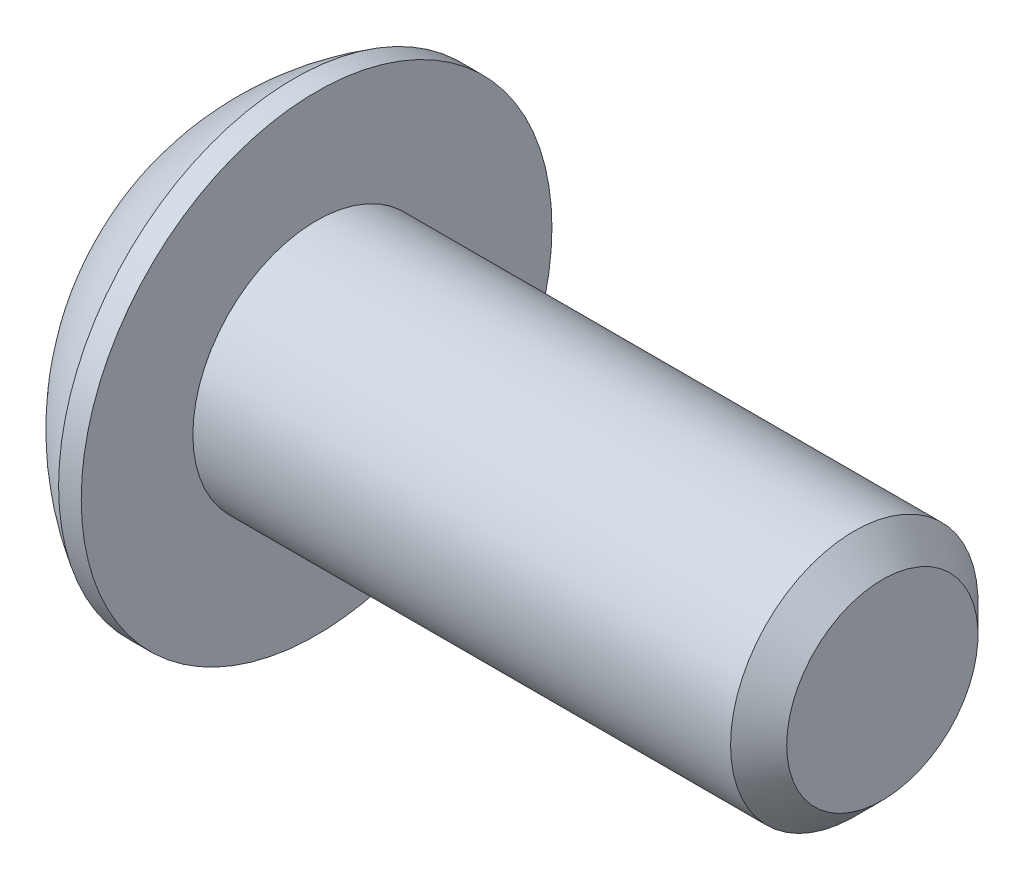
ISO-10303-21;
HEADER;
FILE_DESCRIPTION(('STEP AP214'),'2;1');
FILE_NAME('part.step','',(''),(''),'','','');
FILE_SCHEMA(('AUTOMOTIVE_DESIGN { 1 0 10303 214 1 1 1 1 }'));
ENDSEC;
DATA;
#1=APPLICATION_CONTEXT('core data for automotive mechanical design processes');
#2=APPLICATION_PROTOCOL_DEFINITION('international standard','automotive_design',2000,#1);
#3=PRODUCT_CONTEXT('',#1,'mechanical');
#4=PRODUCT('Part','Part','',(#3));
#5=PRODUCT_RELATED_PRODUCT_CATEGORY('part','',(#4));
#6=PRODUCT_DEFINITION_FORMATION('','',#4);
#7=PRODUCT_DEFINITION_CONTEXT('part definition',#1,'design');
#8=PRODUCT_DEFINITION('design','',#6,#7);
#9=PRODUCT_DEFINITION_SHAPE('','',#8);
#10=(LENGTH_UNIT() NAMED_UNIT(*) SI_UNIT(.MILLI.,.METRE.));
#11=(NAMED_UNIT(*) PLANE_ANGLE_UNIT() SI_UNIT($,.RADIAN.));
#12=(NAMED_UNIT(*) SI_UNIT($,.STERADIAN.) SOLID_ANGLE_UNIT());
#13=UNCERTAINTY_MEASURE_WITH_UNIT(LENGTH_MEASURE(1.E-05),#10,'distance_accuracy_value','');
#14=(GEOMETRIC_REPRESENTATION_CONTEXT(3) GLOBAL_UNCERTAINTY_ASSIGNED_CONTEXT((#13)) GLOBAL_UNIT_ASSIGNED_CONTEXT((#10,
#11,#12)) REPRESENTATION_CONTEXT('',''));
#15=CARTESIAN_POINT('',(0.,0.,0.));
#16=DIRECTION('',(0.,0.,1.));
#17=DIRECTION('',(1.,0.,0.));
#18=AXIS2_PLACEMENT_3D('',#15,#16,#17);
#19=CARTESIAN_POINT('',(1.32080000014412,0.,0.));
#20=DIRECTION('',(-1.,0.,0.));
#21=DIRECTION('',(0.,0.,1.));
#22=AXIS2_PLACEMENT_3D('',#19,#20,#21);
#23=CONICAL_SURFACE('',#22,1.19379999978264,1.04719755093309);
#24=CARTESIAN_POINT('',(2.01004075151445,0.,2.27373675443232E-10));
#25=VERTEX_POINT('',#24);
#26=VERTEX_LOOP('',#25);
#27=FACE_BOUND('',#26,.T.);
#28=CARTESIAN_POINT('',(1.32080000001284,0.,0.));
#29=DIRECTION('',(-1.,0.,0.));
#30=DIRECTION('',(0.,0.,1.));
#31=AXIS2_PLACEMENT_3D('',#28,#29,#30);
#32=CIRCLE('',#31,1.19380000001001);
#33=CARTESIAN_POINT('',(1.32080000000644,-1.0338611270422,0.596900000002507));
#34=VERTEX_POINT('',#33);
#35=CARTESIAN_POINT('',(1.32080000000644,0.,1.19380000000501));
#36=VERTEX_POINT('',#35);
#37=EDGE_CURVE('E92',#34,#36,#32,.T.);
#38=ORIENTED_EDGE('',*,*,#37,.T.);
#39=CARTESIAN_POINT('',(1.32080000001284,0.,0.));
#40=DIRECTION('',(-1.,0.,0.));
#41=DIRECTION('',(0.,0.,1.));
#42=AXIS2_PLACEMENT_3D('',#39,#40,#41);
#43=CIRCLE('',#42,1.19380000001001);
#44=CARTESIAN_POINT('',(1.32080000000644,1.0338611270422,0.596900000002507));
#45=VERTEX_POINT('',#44);
#46=EDGE_CURVE('E88',#36,#45,#43,.T.);
#47=ORIENTED_EDGE('',*,*,#46,.T.);
#48=CARTESIAN_POINT('',(1.32080000001284,0.,0.));
#49=DIRECTION('',(-1.,0.,0.));
#50=DIRECTION('',(0.,0.,1.));
#51=AXIS2_PLACEMENT_3D('',#48,#49,#50);
#52=CIRCLE('',#51,1.19380000001001);
#53=CARTESIAN_POINT('',(1.32080000000644,1.0338611270422,-0.596900000002503));
#54=VERTEX_POINT('',#53);
#55=EDGE_CURVE('E21',#45,#54,#52,.T.);
#56=ORIENTED_EDGE('',*,*,#55,.T.);
#57=CARTESIAN_POINT('',(1.32080000001284,0.,0.));
#58=DIRECTION('',(-1.,0.,0.));
#59=DIRECTION('',(0.,0.,1.));
#60=AXIS2_PLACEMENT_3D('',#57,#58,#59);
#61=CIRCLE('',#60,1.19380000001001);
#62=CARTESIAN_POINT('',(1.32080000000644,1.49193044797401E-12,-1.193800000005));
#63=VERTEX_POINT('',#62);
#64=EDGE_CURVE('E151',#54,#63,#61,.T.);
#65=ORIENTED_EDGE('',*,*,#64,.T.);
#66=CARTESIAN_POINT('',(1.32080000001284,0.,0.));
#67=DIRECTION('',(-1.,0.,0.));
#68=DIRECTION('',(0.,0.,1.));
#69=AXIS2_PLACEMENT_3D('',#66,#67,#68);
#70=CIRCLE('',#69,1.19380000001001);
#71=CARTESIAN_POINT('',(1.32080000000644,-1.03386112704219,-0.596900000002507));
#72=VERTEX_POINT('',#71);
#73=EDGE_CURVE('E153',#63,#72,#70,.T.);
#74=ORIENTED_EDGE('',*,*,#73,.T.);
#75=CARTESIAN_POINT('',(1.32080000001284,0.,0.));
#76=DIRECTION('',(-1.,0.,0.));
#77=DIRECTION('',(0.,0.,1.));
#78=AXIS2_PLACEMENT_3D('',#75,#76,#77);
#79=CIRCLE('',#78,1.19380000001001);
#80=EDGE_CURVE('E155',#72,#34,#79,.T.);
#81=ORIENTED_EDGE('',*,*,#80,.T.);
#82=EDGE_LOOP('',(#38,#47,#56,#65,#74,#81));
#83=FACE_BOUND('',#82,.T.);
#84=ADVANCED_FACE('F17',(#27,#83),#23,.F.);
#85=CARTESIAN_POINT('',(1.32080000000001,-2.06772225407572,-1.19379999999998));
#86=DIRECTION('',(1.,0.,0.));
#87=DIRECTION('',(0.,0.,-1.));
#88=AXIS2_PLACEMENT_3D('',#85,#86,#87);
#89=PLANE('',#88);
#90=DIRECTION('',(0.,-0.5,-0.866025403784439));
#91=VECTOR('',#90,1.);
#92=CARTESIAN_POINT('',(1.32080000000004,1.37848150271715,0.));
#93=LINE('',#92,#91);
#94=CARTESIAN_POINT('',(1.32080000000002,1.37848150271715,0.));
#95=VERTEX_POINT('',#94);
#96=EDGE_CURVE('E104',#54,#95,#93,.F.);
#97=ORIENTED_EDGE('',*,*,#96,.F.);
#98=ORIENTED_EDGE('',*,*,#55,.F.);
#99=DIRECTION('',(0.,0.5,-0.866025403784439));
#100=VECTOR('',#99,1.);
#101=CARTESIAN_POINT('',(1.32080000000001,0.689240751358577,1.1938));
#102=LINE('',#101,#100);
#103=EDGE_CURVE('E102',#95,#45,#102,.F.);
#104=ORIENTED_EDGE('',*,*,#103,.F.);
#105=EDGE_LOOP('',(#97,#98,#104));
#106=FACE_BOUND('',#105,.T.);
#107=ADVANCED_FACE('F100',(#106),#89,.F.);
#108=CARTESIAN_POINT('',(1.32080000000001,-2.06772225407572,-1.19379999999998));
#109=DIRECTION('',(1.,0.,0.));
#110=DIRECTION('',(0.,0.,-1.));
#111=AXIS2_PLACEMENT_3D('',#108,#109,#110);
#112=PLANE('',#111);
#113=DIRECTION('',(0.,0.5,-0.866025403784439));
#114=VECTOR('',#113,1.);
#115=CARTESIAN_POINT('',(1.32080000000004,0.689240751358577,1.1938));
#116=LINE('',#115,#114);
#117=CARTESIAN_POINT('',(1.32080000000002,0.689240751358577,1.1938));
#118=VERTEX_POINT('',#117);
#119=EDGE_CURVE('E106',#45,#118,#116,.F.);
#120=ORIENTED_EDGE('',*,*,#119,.F.);
#121=ORIENTED_EDGE('',*,*,#46,.F.);
#122=DIRECTION('',(0.,1.,0.));
#123=VECTOR('',#122,1.);
#124=CARTESIAN_POINT('',(1.32080000000001,-0.689240751358573,1.19380000000001));
#125=LINE('',#124,#123);
#126=EDGE_CURVE('E109',#118,#36,#125,.F.);
#127=ORIENTED_EDGE('',*,*,#126,.F.);
#128=EDGE_LOOP('',(#120,#121,#127));
#129=FACE_BOUND('',#128,.T.);
#130=ADVANCED_FACE('F107',(#129),#112,.F.);
#131=CARTESIAN_POINT('',(1.32080000000001,-2.06772225407572,-1.19379999999998));
#132=DIRECTION('',(1.,0.,0.));
#133=DIRECTION('',(0.,0.,-1.));
#134=AXIS2_PLACEMENT_3D('',#131,#132,#133);
#135=PLANE('',#134);
#136=DIRECTION('',(0.,1.,0.));
#137=VECTOR('',#136,1.);
#138=CARTESIAN_POINT('',(1.32080000000004,-0.689240751358573,1.19380000000001));
#139=LINE('',#138,#137);
#140=CARTESIAN_POINT('',(1.32080000000002,-0.689240751358577,1.19380000000001));
#141=VERTEX_POINT('',#140);
#142=EDGE_CURVE('E169',#36,#141,#139,.F.);
#143=ORIENTED_EDGE('',*,*,#142,.F.);
#144=ORIENTED_EDGE('',*,*,#37,.F.);
#145=DIRECTION('',(0.,0.5,0.866025403784439));
#146=VECTOR('',#145,1.);
#147=CARTESIAN_POINT('',(1.32080000000001,-1.37848150271715,0.));
#148=LINE('',#147,#146);
#149=EDGE_CURVE('E167',#141,#34,#148,.F.);
#150=ORIENTED_EDGE('',*,*,#149,.F.);
#151=EDGE_LOOP('',(#143,#144,#150));
#152=FACE_BOUND('',#151,.T.);
#153=ADVANCED_FACE('F165',(#152),#135,.F.);
#154=CARTESIAN_POINT('',(1.32080000000001,-2.06772225407572,-1.19379999999998));
#155=DIRECTION('',(1.,0.,0.));
#156=DIRECTION('',(0.,0.,-1.));
#157=AXIS2_PLACEMENT_3D('',#154,#155,#156);
#158=PLANE('',#157);
#159=DIRECTION('',(0.,0.5,0.866025403784439));
#160=VECTOR('',#159,1.);
#161=CARTESIAN_POINT('',(1.32080000000004,-1.37848150271715,0.));
#162=LINE('',#161,#160);
#163=CARTESIAN_POINT('',(1.32080000000002,-1.37848150271715,0.));
#164=VERTEX_POINT('',#163);
#165=EDGE_CURVE('E170',#34,#164,#162,.F.);
#166=ORIENTED_EDGE('',*,*,#165,.F.);
#167=ORIENTED_EDGE('',*,*,#80,.F.);
#168=DIRECTION('',(0.,-0.5,0.866025403784439));
#169=VECTOR('',#168,1.);
#170=CARTESIAN_POINT('',(1.32080000000001,-0.689240751358573,-1.19379999999999));
#171=LINE('',#170,#169);
#172=EDGE_CURVE('E173',#164,#72,#171,.F.);
#173=ORIENTED_EDGE('',*,*,#172,.F.);
#174=EDGE_LOOP('',(#166,#167,#173));
#175=FACE_BOUND('',#174,.T.);
#176=ADVANCED_FACE('F171',(#175),#158,.F.);
#177=CARTESIAN_POINT('',(1.32080000000001,-2.06772225407572,-1.19379999999998));
#178=DIRECTION('',(1.,0.,0.));
#179=DIRECTION('',(0.,0.,-1.));
#180=AXIS2_PLACEMENT_3D('',#177,#178,#179);
#181=PLANE('',#180);
#182=DIRECTION('',(0.,-0.5,0.866025403784439));
#183=VECTOR('',#182,1.);
#184=CARTESIAN_POINT('',(1.32080000000004,-0.689240751358573,-1.19379999999999));
#185=LINE('',#184,#183);
#186=CARTESIAN_POINT('',(1.32080000000002,-0.689240751358573,-1.19379999999999));
#187=VERTEX_POINT('',#186);
#188=EDGE_CURVE('E228',#72,#187,#185,.F.);
#189=ORIENTED_EDGE('',*,*,#188,.F.);
#190=ORIENTED_EDGE('',*,*,#73,.F.);
#191=DIRECTION('',(0.,1.,0.));
#192=VECTOR('',#191,1.);
#193=CARTESIAN_POINT('',(1.32080000000001,0.689240751358577,-1.19379999999999));
#194=LINE('',#193,#192);
#195=EDGE_CURVE('E240',#187,#63,#194,.T.);
#196=ORIENTED_EDGE('',*,*,#195,.F.);
#197=EDGE_LOOP('',(#189,#190,#196));
#198=FACE_BOUND('',#197,.T.);
#199=ADVANCED_FACE('F390',(#198),#181,.F.);
#200=CARTESIAN_POINT('',(1.32080000000001,-2.06772225407572,-1.19379999999998));
#201=DIRECTION('',(1.,0.,0.));
#202=DIRECTION('',(0.,0.,-1.));
#203=AXIS2_PLACEMENT_3D('',#200,#201,#202);
#204=PLANE('',#203);
#205=DIRECTION('',(0.,1.,0.));
#206=VECTOR('',#205,1.);
#207=CARTESIAN_POINT('',(1.32080000000004,0.689240751358577,-1.19379999999999));
#208=LINE('',#207,#206);
#209=CARTESIAN_POINT('',(1.32080000000002,0.689240751358564,-1.19380000000002));
#210=VERTEX_POINT('',#209);
#211=EDGE_CURVE('E248',#63,#210,#208,.T.);
#212=ORIENTED_EDGE('',*,*,#211,.F.);
#213=ORIENTED_EDGE('',*,*,#64,.F.);
#214=DIRECTION('',(0.,-0.5,-0.866025403784439));
#215=VECTOR('',#214,1.);
#216=CARTESIAN_POINT('',(1.32080000000001,1.37848150271715,0.));
#217=LINE('',#216,#215);
#218=EDGE_CURVE('E128',#210,#54,#217,.F.);
#219=ORIENTED_EDGE('',*,*,#218,.F.);
#220=EDGE_LOOP('',(#212,#213,#219));
#221=FACE_BOUND('',#220,.T.);
#222=ADVANCED_FACE('F380',(#221),#204,.F.);
#223=CARTESIAN_POINT('',(1.32080000000001,1.37848150271715,0.));
#224=DIRECTION('',(0.,-0.866025403784439,0.5));
#225=DIRECTION('',(0.,-0.5,-0.866025403784439));
#226=AXIS2_PLACEMENT_3D('',#223,#224,#225);
#227=PLANE('',#226);
#228=ORIENTED_EDGE('',*,*,#96,.T.);
#229=DIRECTION('',(1.,0.,0.));
#230=VECTOR('',#229,1.);
#231=CARTESIAN_POINT('',(1.32080000000001,1.37848150271715,0.));
#232=LINE('',#231,#230);
#233=CARTESIAN_POINT('',(0.,1.37848150271715,0.));
#234=VERTEX_POINT('',#233);
#235=EDGE_CURVE('E116',#234,#95,#232,.T.);
#236=ORIENTED_EDGE('',*,*,#235,.F.);
#237=DIRECTION('',(0.,0.499999999999998,0.86602540378444));
#238=VECTOR('',#237,1.);
#239=CARTESIAN_POINT('',(0.,0.689240751358577,-1.1938));
#240=LINE('',#239,#238);
#241=CARTESIAN_POINT('',(0.,0.689240751358577,-1.1938));
#242=VERTEX_POINT('',#241);
#243=EDGE_CURVE('E131',#242,#234,#240,.T.);
#244=ORIENTED_EDGE('',*,*,#243,.F.);
#245=DIRECTION('',(1.,0.,0.));
#246=VECTOR('',#245,1.);
#247=CARTESIAN_POINT('',(1.32080000000001,0.689240751358577,-1.19379999999999));
#248=LINE('',#247,#246);
#249=EDGE_CURVE('E135',#210,#242,#248,.F.);
#250=ORIENTED_EDGE('',*,*,#249,.F.);
#251=ORIENTED_EDGE('',*,*,#218,.T.);
#252=EDGE_LOOP('',(#228,#236,#244,#250,#251));
#253=FACE_BOUND('',#252,.T.);
#254=ADVANCED_FACE('F371',(#253),#227,.T.);
#255=CARTESIAN_POINT('',(1.32080000000001,0.689240751358577,1.1938));
#256=DIRECTION('',(0.,-0.866025403784439,-0.5));
#257=DIRECTION('',(0.,0.5,-0.866025403784439));
#258=AXIS2_PLACEMENT_3D('',#255,#256,#257);
#259=PLANE('',#258);
#260=ORIENTED_EDGE('',*,*,#119,.T.);
#261=DIRECTION('',(1.,0.,0.));
#262=VECTOR('',#261,1.);
#263=CARTESIAN_POINT('',(1.32080000000001,0.689240751358577,1.19380000000001));
#264=LINE('',#263,#262);
#265=CARTESIAN_POINT('',(0.,0.689240751358577,1.1938));
#266=VERTEX_POINT('',#265);
#267=EDGE_CURVE('E112',#266,#118,#264,.T.);
#268=ORIENTED_EDGE('',*,*,#267,.F.);
#269=DIRECTION('',(0.,-0.500000000000004,0.866025403784437));
#270=VECTOR('',#269,1.);
#271=CARTESIAN_POINT('',(0.,1.37848150271715,0.));
#272=LINE('',#271,#270);
#273=EDGE_CURVE('E134',#234,#266,#272,.T.);
#274=ORIENTED_EDGE('',*,*,#273,.F.);
#275=ORIENTED_EDGE('',*,*,#235,.T.);
#276=ORIENTED_EDGE('',*,*,#103,.T.);
#277=EDGE_LOOP('',(#260,#268,#274,#275,#276));
#278=FACE_BOUND('',#277,.T.);
#279=ADVANCED_FACE('F114',(#278),#259,.T.);
#280=CARTESIAN_POINT('',(1.32080000000001,-0.689240751358573,1.19380000000001));
#281=DIRECTION('',(0.,0.,-1.));
#282=DIRECTION('',(0.,1.,0.));
#283=AXIS2_PLACEMENT_3D('',#280,#281,#282);
#284=PLANE('',#283);
#285=ORIENTED_EDGE('',*,*,#142,.T.);
#286=DIRECTION('',(1.,0.,0.));
#287=VECTOR('',#286,1.);
#288=CARTESIAN_POINT('',(1.32080000000001,-0.689240751358579,1.19380000000001));
#289=LINE('',#288,#287);
#290=CARTESIAN_POINT('',(0.,-0.689240751358577,1.19380000000001));
#291=VERTEX_POINT('',#290);
#292=EDGE_CURVE('E180',#291,#141,#289,.T.);
#293=ORIENTED_EDGE('',*,*,#292,.F.);
#294=DIRECTION('',(0.,1.,0.));
#295=VECTOR('',#294,1.);
#296=CARTESIAN_POINT('',(0.,0.,1.1938));
#297=LINE('',#296,#295);
#298=EDGE_CURVE('E194',#266,#291,#297,.F.);
#299=ORIENTED_EDGE('',*,*,#298,.F.);
#300=ORIENTED_EDGE('',*,*,#267,.T.);
#301=ORIENTED_EDGE('',*,*,#126,.T.);
#302=EDGE_LOOP('',(#285,#293,#299,#300,#301));
#303=FACE_BOUND('',#302,.T.);
#304=ADVANCED_FACE('F216',(#303),#284,.T.);
#305=CARTESIAN_POINT('',(1.32080000000001,-1.37848150271715,0.));
#306=DIRECTION('',(0.,0.866025403784439,-0.5));
#307=DIRECTION('',(0.,0.5,0.866025403784439));
#308=AXIS2_PLACEMENT_3D('',#305,#306,#307);
#309=PLANE('',#308);
#310=ORIENTED_EDGE('',*,*,#165,.T.);
#311=DIRECTION('',(1.,0.,0.));
#312=VECTOR('',#311,1.);
#313=CARTESIAN_POINT('',(1.32080000000001,-1.37848150271715,0.));
#314=LINE('',#313,#312);
#315=CARTESIAN_POINT('',(0.,-1.37848150271715,0.));
#316=VERTEX_POINT('',#315);
#317=EDGE_CURVE('E176',#316,#164,#314,.T.);
#318=ORIENTED_EDGE('',*,*,#317,.F.);
#319=DIRECTION('',(0.,-0.499999999999999,-0.866025403784439));
#320=VECTOR('',#319,1.);
#321=CARTESIAN_POINT('',(0.,-0.689240751358573,1.19380000000001));
#322=LINE('',#321,#320);
#323=EDGE_CURVE('E197',#291,#316,#322,.T.);
#324=ORIENTED_EDGE('',*,*,#323,.F.);
#325=ORIENTED_EDGE('',*,*,#292,.T.);
#326=ORIENTED_EDGE('',*,*,#149,.T.);
#327=EDGE_LOOP('',(#310,#318,#324,#325,#326));
#328=FACE_BOUND('',#327,.T.);
#329=ADVANCED_FACE('F178',(#328),#309,.T.);
#330=CARTESIAN_POINT('',(1.32080000000001,-0.689240751358573,-1.19379999999999));
#331=DIRECTION('',(0.,0.866025403784439,0.5));
#332=DIRECTION('',(0.,-0.5,0.866025403784439));
#333=AXIS2_PLACEMENT_3D('',#330,#331,#332);
#334=PLANE('',#333);
#335=ORIENTED_EDGE('',*,*,#188,.T.);
#336=DIRECTION('',(1.,0.,0.));
#337=VECTOR('',#336,1.);
#338=CARTESIAN_POINT('',(1.32080000000001,-0.689240751358573,-1.19379999999999));
#339=LINE('',#338,#337);
#340=CARTESIAN_POINT('',(0.,-0.689240751358573,-1.19379999999999));
#341=VERTEX_POINT('',#340);
#342=EDGE_CURVE('E36',#341,#187,#339,.T.);
#343=ORIENTED_EDGE('',*,*,#342,.F.);
#344=DIRECTION('',(0.,0.499999999999998,-0.86602540378444));
#345=VECTOR('',#344,1.);
#346=CARTESIAN_POINT('',(0.,-1.37848150271715,0.));
#347=LINE('',#346,#345);
#348=EDGE_CURVE('E217',#316,#341,#347,.T.);
#349=ORIENTED_EDGE('',*,*,#348,.F.);
#350=ORIENTED_EDGE('',*,*,#317,.T.);
#351=ORIENTED_EDGE('',*,*,#172,.T.);
#352=EDGE_LOOP('',(#335,#343,#349,#350,#351));
#353=FACE_BOUND('',#352,.T.);
#354=ADVANCED_FACE('F337',(#353),#334,.T.);
#355=CARTESIAN_POINT('',(1.32080000000001,0.689240751358577,-1.19379999999999));
#356=DIRECTION('',(0.,0.,1.));
#357=DIRECTION('',(1.,0.,0.));
#358=AXIS2_PLACEMENT_3D('',#355,#356,#357);
#359=PLANE('',#358);
#360=ORIENTED_EDGE('',*,*,#211,.T.);
#361=ORIENTED_EDGE('',*,*,#249,.T.);
#362=DIRECTION('',(0.,1.,0.));
#363=VECTOR('',#362,1.);
#364=CARTESIAN_POINT('',(0.,0.,-1.19379999999999));
#365=LINE('',#364,#363);
#366=EDGE_CURVE('E150',#341,#242,#365,.T.);
#367=ORIENTED_EDGE('',*,*,#366,.F.);
#368=ORIENTED_EDGE('',*,*,#342,.T.);
#369=ORIENTED_EDGE('',*,*,#195,.T.);
#370=EDGE_LOOP('',(#360,#361,#367,#368,#369));
#371=FACE_BOUND('',#370,.T.);
#372=ADVANCED_FACE('F328',(#371),#359,.T.);
#373=CARTESIAN_POINT('',(0.,0.,0.));
#374=DIRECTION('',(-1.,0.,0.));
#375=DIRECTION('',(0.,0.,1.));
#376=AXIS2_PLACEMENT_3D('',#373,#374,#375);
#377=PLANE('',#376);
#378=CARTESIAN_POINT('',(0.,0.,0.));
#379=DIRECTION('',(-1.,0.,0.));
#380=DIRECTION('',(0.,0.,1.));
#381=AXIS2_PLACEMENT_3D('',#378,#379,#380);
#382=CIRCLE('',#381,1.98120000000003);
#383=CARTESIAN_POINT('',(0.,0.,1.98120000000004));
#384=VERTEX_POINT('',#383);
#385=EDGE_CURVE('E147',#384,#384,#382,.F.);
#386=ORIENTED_EDGE('',*,*,#385,.F.);
#387=EDGE_LOOP('',(#386));
#388=FACE_BOUND('',#387,.T.);
#389=ORIENTED_EDGE('',*,*,#348,.T.);
#390=ORIENTED_EDGE('',*,*,#366,.T.);
#391=ORIENTED_EDGE('',*,*,#243,.T.);
#392=ORIENTED_EDGE('',*,*,#273,.T.);
#393=ORIENTED_EDGE('',*,*,#298,.T.);
#394=ORIENTED_EDGE('',*,*,#323,.T.);
#395=EDGE_LOOP('',(#389,#390,#391,#392,#393,#394));
#396=FACE_BOUND('',#395,.T.);
#397=ADVANCED_FACE('F210',(#388,#396),#377,.T.);
#398=CARTESIAN_POINT('',(4.13384999999999,0.,0.));
#399=DIRECTION('',(0.,1.,0.));
#400=DIRECTION('',(-0.48966740395494,0.,-0.87190930348519));
#401=AXIS2_PLACEMENT_3D('',#398,#399,#400);
#402=SPHERICAL_SURFACE('',#401,4.5840887057844);
#403=CARTESIAN_POINT('',(4.13384999999999,0.,0.));
#404=DIRECTION('',(-1.,0.,0.));
#405=DIRECTION('',(0.,0.,1.));
#406=AXIS2_PLACEMENT_3D('',#403,#404,#405);
#407=SPHERICAL_SURFACE('',#406,4.5840887057844);
#408=ORIENTED_EDGE('',*,*,#385,.T.);
#409=EDGE_LOOP('',(#408));
#410=FACE_BOUND('',#409,.T.);
#411=CARTESIAN_POINT('',(1.82879999999999,0.,0.));
#412=DIRECTION('',(-1.,0.,0.));
#413=DIRECTION('',(0.,0.,1.));
#414=AXIS2_PLACEMENT_3D('',#411,#412,#413);
#415=CIRCLE('',#414,3.9624);
#416=CARTESIAN_POINT('',(1.82879999999999,0.,3.9624));
#417=VERTEX_POINT('',#416);
#418=EDGE_CURVE('E144',#417,#417,#415,.F.);
#419=ORIENTED_EDGE('',*,*,#418,.F.);
#420=EDGE_LOOP('',(#419));
#421=FACE_BOUND('',#420,.T.);
#422=ADVANCED_FACE('F19',(#410,#421),#407,.T.);
#423=CARTESIAN_POINT('',(11.7348,0.,0.));
#424=DIRECTION('',(-1.,0.,0.));
#425=DIRECTION('',(0.,0.,1.));
#426=AXIS2_PLACEMENT_3D('',#423,#424,#425);
#427=PLANE('',#426);
#428=CARTESIAN_POINT('',(11.7347999999993,0.,0.));
#429=DIRECTION('',(-1.,0.,0.));
#430=DIRECTION('',(0.,0.,1.));
#431=AXIS2_PLACEMENT_3D('',#428,#429,#430);
#432=CIRCLE('',#431,1.61035999997239);
#433=CARTESIAN_POINT('',(11.7347999999993,0.,1.61035999997239));
#434=VERTEX_POINT('',#433);
#435=EDGE_CURVE('E141',#434,#434,#432,.T.);
#436=ORIENTED_EDGE('',*,*,#435,.F.);
#437=EDGE_LOOP('',(#436));
#438=FACE_BOUND('',#437,.T.);
#439=ADVANCED_FACE('F270',(#438),#427,.F.);
#440=CARTESIAN_POINT('',(0.,0.,0.));
#441=DIRECTION('',(-1.,0.,0.));
#442=DIRECTION('',(0.,0.,1.));
#443=AXIS2_PLACEMENT_3D('',#440,#441,#442);
#444=CYLINDRICAL_SURFACE('',#443,3.9624);
#445=ORIENTED_EDGE('',*,*,#418,.T.);
#446=EDGE_LOOP('',(#445));
#447=FACE_BOUND('',#446,.T.);
#448=CARTESIAN_POINT('',(2.20980000000001,0.,0.));
#449=DIRECTION('',(-1.,0.,0.));
#450=DIRECTION('',(0.,0.,1.));
#451=AXIS2_PLACEMENT_3D('',#448,#449,#450);
#452=CIRCLE('',#451,3.9624);
#453=CARTESIAN_POINT('',(2.20980000000001,0.,3.9624));
#454=VERTEX_POINT('',#453);
#455=EDGE_CURVE('E138',#454,#454,#452,.T.);
#456=ORIENTED_EDGE('',*,*,#455,.T.);
#457=EDGE_LOOP('',(#456));
#458=FACE_BOUND('',#457,.T.);
#459=ADVANCED_FACE('F266',(#447,#458),#444,.T.);
#460=CARTESIAN_POINT('',(11.2623600001029,0.,0.));
#461=DIRECTION('',(-1.,0.,0.));
#462=DIRECTION('',(0.,0.,1.));
#463=AXIS2_PLACEMENT_3D('',#460,#461,#462);
#464=CONICAL_SURFACE('',#463,2.08279999986871,0.785398163397448);
#465=CARTESIAN_POINT('',(11.26236,0.,0.));
#466=DIRECTION('',(-1.,0.,0.));
#467=DIRECTION('',(0.,0.,1.));
#468=AXIS2_PLACEMENT_3D('',#465,#466,#467);
#469=CIRCLE('',#468,2.0828);
#470=CARTESIAN_POINT('',(11.26236,0.,2.0828));
#471=VERTEX_POINT('',#470);
#472=EDGE_CURVE('E27',#471,#471,#469,.T.);
#473=ORIENTED_EDGE('',*,*,#472,.F.);
#474=EDGE_LOOP('',(#473));
#475=FACE_BOUND('',#474,.T.);
#476=ORIENTED_EDGE('',*,*,#435,.T.);
#477=EDGE_LOOP('',(#476));
#478=FACE_BOUND('',#477,.T.);
#479=ADVANCED_FACE('F262',(#475,#478),#464,.T.);
#480=CARTESIAN_POINT('',(2.20980000000001,2.0828,0.));
#481=DIRECTION('',(-1.,0.,0.));
#482=DIRECTION('',(0.,0.,1.));
#483=AXIS2_PLACEMENT_3D('',#480,#481,#482);
#484=PLANE('',#483);
#485=ORIENTED_EDGE('',*,*,#455,.F.);
#486=EDGE_LOOP('',(#485));
#487=FACE_BOUND('',#486,.T.);
#488=CARTESIAN_POINT('',(2.20980000000001,0.,0.));
#489=DIRECTION('',(-1.,0.,0.));
#490=DIRECTION('',(0.,0.,1.));
#491=AXIS2_PLACEMENT_3D('',#488,#489,#490);
#492=CIRCLE('',#491,2.0828);
#493=CARTESIAN_POINT('',(2.20980000000001,0.,2.0828));
#494=VERTEX_POINT('',#493);
#495=EDGE_CURVE('E11',#494,#494,#492,.F.);
#496=ORIENTED_EDGE('',*,*,#495,.F.);
#497=EDGE_LOOP('',(#496));
#498=FACE_BOUND('',#497,.T.);
#499=ADVANCED_FACE('F265',(#487,#498),#484,.F.);
#500=CARTESIAN_POINT('',(0.,0.,0.));
#501=DIRECTION('',(-1.,0.,0.));
#502=DIRECTION('',(0.,0.,1.));
#503=AXIS2_PLACEMENT_3D('',#500,#501,#502);
#504=CYLINDRICAL_SURFACE('',#503,2.0828);
#505=ORIENTED_EDGE('',*,*,#495,.T.);
#506=EDGE_LOOP('',(#505));
#507=FACE_BOUND('',#506,.T.);
#508=ORIENTED_EDGE('',*,*,#472,.T.);
#509=EDGE_LOOP('',(#508));
#510=FACE_BOUND('',#509,.T.);
#511=ADVANCED_FACE('F260',(#507,#510),#504,.T.);
#512=CLOSED_SHELL('',(#84,#107,#130,#153,#176,#199,#222,#254,#279,#304,#329,#354,#372,#397,#422,
#439,#459,#479,#499,#511));
#513=MANIFOLD_SOLID_BREP('B1',#512);
#514=ADVANCED_BREP_SHAPE_REPRESENTATION('',(#18,#513),#14);
#515=SHAPE_DEFINITION_REPRESENTATION(#9,#514);
ENDSEC;
END-ISO-10303-21;
